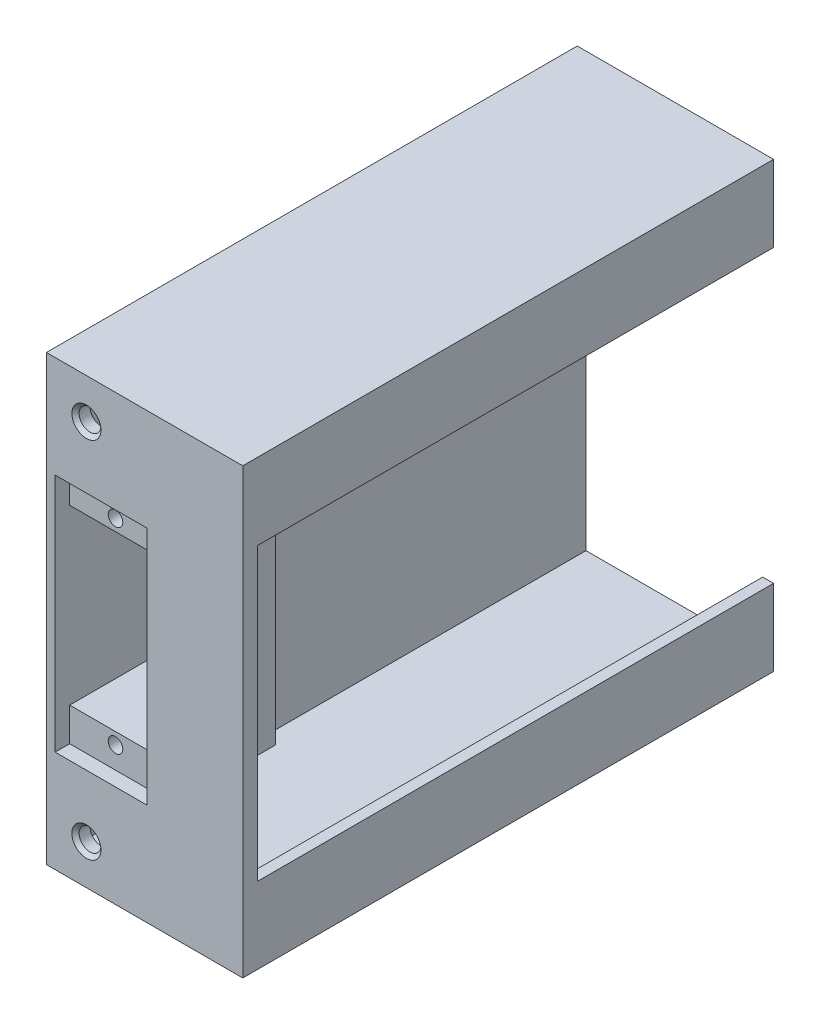
ISO-10303-21;
HEADER;
FILE_DESCRIPTION(('STEP AP214'),'2;1');
FILE_NAME('part.step','',(''),(''),'','','');
FILE_SCHEMA(('AUTOMOTIVE_DESIGN { 1 0 10303 214 1 1 1 1 }'));
ENDSEC;
DATA;
#1=APPLICATION_CONTEXT('core data for automotive mechanical design processes');
#2=APPLICATION_PROTOCOL_DEFINITION('international standard','automotive_design',2000,#1);
#3=PRODUCT_CONTEXT('',#1,'mechanical');
#4=PRODUCT('Part','Part','',(#3));
#5=PRODUCT_RELATED_PRODUCT_CATEGORY('part','',(#4));
#6=PRODUCT_DEFINITION_FORMATION('','',#4);
#7=PRODUCT_DEFINITION_CONTEXT('part definition',#1,'design');
#8=PRODUCT_DEFINITION('design','',#6,#7);
#9=PRODUCT_DEFINITION_SHAPE('','',#8);
#10=(LENGTH_UNIT() NAMED_UNIT(*) SI_UNIT(.MILLI.,.METRE.));
#11=(NAMED_UNIT(*) PLANE_ANGLE_UNIT() SI_UNIT($,.RADIAN.));
#12=(NAMED_UNIT(*) SI_UNIT($,.STERADIAN.) SOLID_ANGLE_UNIT());
#13=UNCERTAINTY_MEASURE_WITH_UNIT(LENGTH_MEASURE(1.E-05),#10,'distance_accuracy_value','');
#14=(GEOMETRIC_REPRESENTATION_CONTEXT(3) GLOBAL_UNCERTAINTY_ASSIGNED_CONTEXT((#13)) GLOBAL_UNIT_ASSIGNED_CONTEXT((#10,
#11,#12)) REPRESENTATION_CONTEXT('',''));
#15=CARTESIAN_POINT('',(0.,0.,0.));
#16=DIRECTION('',(0.,0.,1.));
#17=DIRECTION('',(1.,0.,0.));
#18=AXIS2_PLACEMENT_3D('',#15,#16,#17);
#19=CARTESIAN_POINT('',(25.5,20.,36.5));
#20=DIRECTION('',(0.,1.,0.));
#21=DIRECTION('',(0.,0.,1.));
#22=AXIS2_PLACEMENT_3D('',#19,#20,#21);
#23=PLANE('',#22);
#24=DIRECTION('',(-1.,0.,0.));
#25=VECTOR('',#24,1.);
#26=CARTESIAN_POINT('',(65.5499687890016,20.,34.5));
#27=LINE('',#26,#25);
#28=CARTESIAN_POINT('',(25.5,20.,34.5));
#29=VERTEX_POINT('',#28);
#30=CARTESIAN_POINT('',(24.,20.,34.5));
#31=VERTEX_POINT('',#30);
#32=EDGE_CURVE('E288',#29,#31,#27,.T.);
#33=ORIENTED_EDGE('',*,*,#32,.T.);
#34=DIRECTION('',(0.,0.,-1.));
#35=VECTOR('',#34,1.);
#36=CARTESIAN_POINT('',(24.,20.,36.5));
#37=LINE('',#36,#35);
#38=CARTESIAN_POINT('',(24.,20.,-36.5));
#39=VERTEX_POINT('',#38);
#40=EDGE_CURVE('E306',#31,#39,#37,.T.);
#41=ORIENTED_EDGE('',*,*,#40,.T.);
#42=DIRECTION('',(-1.,0.,0.));
#43=VECTOR('',#42,1.);
#44=CARTESIAN_POINT('',(25.5,20.,-36.5));
#45=LINE('',#44,#43);
#46=CARTESIAN_POINT('',(25.5,20.,-36.5));
#47=VERTEX_POINT('',#46);
#48=EDGE_CURVE('E318',#47,#39,#45,.T.);
#49=ORIENTED_EDGE('',*,*,#48,.F.);
#50=DIRECTION('',(0.,0.,-1.));
#51=VECTOR('',#50,1.);
#52=CARTESIAN_POINT('',(25.5,20.,36.5));
#53=LINE('',#52,#51);
#54=EDGE_CURVE('E309',#29,#47,#53,.T.);
#55=ORIENTED_EDGE('',*,*,#54,.F.);
#56=EDGE_LOOP('',(#33,#41,#49,#55));
#57=FACE_BOUND('',#56,.T.);
#58=ADVANCED_FACE('F37',(#57),#23,.F.);
#59=CARTESIAN_POINT('',(25.5,-20.,36.5));
#60=DIRECTION('',(0.,-1.,0.));
#61=DIRECTION('',(0.,0.,-1.));
#62=AXIS2_PLACEMENT_3D('',#59,#60,#61);
#63=PLANE('',#62);
#64=DIRECTION('',(-1.,0.,0.));
#65=VECTOR('',#64,1.);
#66=CARTESIAN_POINT('',(65.5499687890016,-20.,34.5));
#67=LINE('',#66,#65);
#68=CARTESIAN_POINT('',(25.5,-20.,34.5));
#69=VERTEX_POINT('',#68);
#70=CARTESIAN_POINT('',(24.,-20.,34.5));
#71=VERTEX_POINT('',#70);
#72=EDGE_CURVE('E281',#69,#71,#67,.T.);
#73=ORIENTED_EDGE('',*,*,#72,.F.);
#74=DIRECTION('',(0.,0.,1.));
#75=VECTOR('',#74,1.);
#76=CARTESIAN_POINT('',(25.5,-20.,36.5));
#77=LINE('',#76,#75);
#78=CARTESIAN_POINT('',(25.5,-20.,-36.5));
#79=VERTEX_POINT('',#78);
#80=EDGE_CURVE('E297',#79,#69,#77,.T.);
#81=ORIENTED_EDGE('',*,*,#80,.F.);
#82=DIRECTION('',(-1.,0.,0.));
#83=VECTOR('',#82,1.);
#84=CARTESIAN_POINT('',(25.5,-20.,-36.5));
#85=LINE('',#84,#83);
#86=CARTESIAN_POINT('',(24.,-20.,-36.5));
#87=VERTEX_POINT('',#86);
#88=EDGE_CURVE('E300',#79,#87,#85,.T.);
#89=ORIENTED_EDGE('',*,*,#88,.T.);
#90=DIRECTION('',(0.,0.,1.));
#91=VECTOR('',#90,1.);
#92=CARTESIAN_POINT('',(24.,-20.,36.5));
#93=LINE('',#92,#91);
#94=EDGE_CURVE('E295',#87,#71,#93,.T.);
#95=ORIENTED_EDGE('',*,*,#94,.T.);
#96=EDGE_LOOP('',(#73,#81,#89,#95));
#97=FACE_BOUND('',#96,.T.);
#98=ADVANCED_FACE('F435',(#97),#63,.F.);
#99=CARTESIAN_POINT('',(0.,0.,34.5));
#100=DIRECTION('',(0.,0.,1.));
#101=DIRECTION('',(1.,0.,0.));
#102=AXIS2_PLACEMENT_3D('',#99,#100,#101);
#103=PLANE('',#102);
#104=CARTESIAN_POINT('',(4.,25.,34.5));
#105=DIRECTION('',(0.,0.,-1.));
#106=DIRECTION('',(-1.,0.,0.));
#107=AXIS2_PLACEMENT_3D('',#104,#105,#106);
#108=CIRCLE('',#107,1.5);
#109=CARTESIAN_POINT('',(2.5,25.,34.5));
#110=VERTEX_POINT('',#109);
#111=EDGE_CURVE('E278',#110,#110,#108,.T.);
#112=ORIENTED_EDGE('',*,*,#111,.F.);
#113=EDGE_LOOP('',(#112));
#114=FACE_BOUND('',#113,.T.);
#115=CARTESIAN_POINT('',(4.,-25.,34.5));
#116=DIRECTION('',(0.,0.,-1.));
#117=DIRECTION('',(-1.,0.,0.));
#118=AXIS2_PLACEMENT_3D('',#115,#116,#117);
#119=CIRCLE('',#118,1.5);
#120=CARTESIAN_POINT('',(2.5,-25.,34.5));
#121=VERTEX_POINT('',#120);
#122=EDGE_CURVE('E277',#121,#121,#119,.T.);
#123=ORIENTED_EDGE('',*,*,#122,.F.);
#124=EDGE_LOOP('',(#123));
#125=FACE_BOUND('',#124,.T.);
#126=DIRECTION('',(0.,-1.,0.));
#127=VECTOR('',#126,1.);
#128=CARTESIAN_POINT('',(13.,17.5,34.5));
#129=LINE('',#128,#127);
#130=CARTESIAN_POINT('',(13.,17.5,34.5));
#131=VERTEX_POINT('',#130);
#132=CARTESIAN_POINT('',(13.,-17.5,34.5));
#133=VERTEX_POINT('',#132);
#134=EDGE_CURVE('E338',#131,#133,#129,.T.);
#135=ORIENTED_EDGE('',*,*,#134,.F.);
#136=DIRECTION('',(1.,0.,0.));
#137=VECTOR('',#136,1.);
#138=CARTESIAN_POINT('',(0.,17.5,34.5));
#139=LINE('',#138,#137);
#140=CARTESIAN_POINT('',(-0.299999999999987,17.5,34.5));
#141=VERTEX_POINT('',#140);
#142=EDGE_CURVE('E355',#141,#131,#139,.T.);
#143=ORIENTED_EDGE('',*,*,#142,.F.);
#144=DIRECTION('',(0.,1.,0.));
#145=VECTOR('',#144,1.);
#146=CARTESIAN_POINT('',(-0.299999999999986,29.,34.5));
#147=LINE('',#146,#145);
#148=CARTESIAN_POINT('',(-0.299999999999986,29.,34.5));
#149=VERTEX_POINT('',#148);
#150=EDGE_CURVE('E236',#141,#149,#147,.T.);
#151=ORIENTED_EDGE('',*,*,#150,.T.);
#152=DIRECTION('',(-1.,0.,0.));
#153=VECTOR('',#152,1.);
#154=CARTESIAN_POINT('',(0.,29.,34.5));
#155=LINE('',#154,#153);
#156=CARTESIAN_POINT('',(24.,29.,34.5));
#157=VERTEX_POINT('',#156);
#158=EDGE_CURVE('E367',#157,#149,#155,.T.);
#159=ORIENTED_EDGE('',*,*,#158,.F.);
#160=DIRECTION('',(0.,1.,0.));
#161=VECTOR('',#160,1.);
#162=CARTESIAN_POINT('',(24.,29.,34.5));
#163=LINE('',#162,#161);
#164=EDGE_CURVE('E363',#31,#157,#163,.T.);
#165=ORIENTED_EDGE('',*,*,#164,.F.);
#166=ORIENTED_EDGE('',*,*,#32,.F.);
#167=DIRECTION('',(0.,1.,0.));
#168=VECTOR('',#167,1.);
#169=CARTESIAN_POINT('',(25.5,-20.,34.5));
#170=LINE('',#169,#168);
#171=EDGE_CURVE('E284',#69,#29,#170,.T.);
#172=ORIENTED_EDGE('',*,*,#171,.F.);
#173=ORIENTED_EDGE('',*,*,#72,.T.);
#174=CARTESIAN_POINT('',(24.,-29.,34.5));
#175=VERTEX_POINT('',#174);
#176=EDGE_CURVE('E364',#175,#71,#163,.T.);
#177=ORIENTED_EDGE('',*,*,#176,.F.);
#178=DIRECTION('',(1.,0.,0.));
#179=VECTOR('',#178,1.);
#180=CARTESIAN_POINT('',(0.,-29.,34.5));
#181=LINE('',#180,#179);
#182=CARTESIAN_POINT('',(-0.299999999999993,-29.,34.5));
#183=VERTEX_POINT('',#182);
#184=EDGE_CURVE('E359',#183,#175,#181,.T.);
#185=ORIENTED_EDGE('',*,*,#184,.F.);
#186=DIRECTION('',(0.,1.,0.));
#187=VECTOR('',#186,1.);
#188=CARTESIAN_POINT('',(-0.299999999999993,-29.,34.5));
#189=LINE('',#188,#187);
#190=CARTESIAN_POINT('',(-0.299999999999991,-17.5,34.5));
#191=VERTEX_POINT('',#190);
#192=EDGE_CURVE('E228',#183,#191,#189,.T.);
#193=ORIENTED_EDGE('',*,*,#192,.T.);
#194=DIRECTION('',(-1.,0.,0.));
#195=VECTOR('',#194,1.);
#196=CARTESIAN_POINT('',(0.,-17.5,34.5));
#197=LINE('',#196,#195);
#198=EDGE_CURVE('E352',#133,#191,#197,.T.);
#199=ORIENTED_EDGE('',*,*,#198,.F.);
#200=EDGE_LOOP('',(#135,#143,#151,#159,#165,#166,#172,#173,#177,#185,#193,#199));
#201=FACE_BOUND('',#200,.T.);
#202=ADVANCED_FACE('F431',(#114,#125,#201),#103,.F.);
#203=CARTESIAN_POINT('',(24.,29.,-36.5));
#204=DIRECTION('',(0.,1.,0.));
#205=DIRECTION('',(0.,0.,1.));
#206=AXIS2_PLACEMENT_3D('',#203,#204,#205);
#207=PLANE('',#206);
#208=ORIENTED_EDGE('',*,*,#158,.T.);
#209=DIRECTION('',(0.,0.,-1.));
#210=VECTOR('',#209,1.);
#211=CARTESIAN_POINT('',(-0.299999999999986,29.,77.5007758568797));
#212=LINE('',#211,#210);
#213=CARTESIAN_POINT('',(-0.299999999999986,29.,-36.5));
#214=VERTEX_POINT('',#213);
#215=EDGE_CURVE('E251',#149,#214,#212,.T.);
#216=ORIENTED_EDGE('',*,*,#215,.T.);
#217=DIRECTION('',(-1.,0.,0.));
#218=VECTOR('',#217,1.);
#219=CARTESIAN_POINT('',(24.,29.,-36.5));
#220=LINE('',#219,#218);
#221=CARTESIAN_POINT('',(24.,29.,-36.5));
#222=VERTEX_POINT('',#221);
#223=EDGE_CURVE('E377',#222,#214,#220,.T.);
#224=ORIENTED_EDGE('',*,*,#223,.F.);
#225=DIRECTION('',(0.,0.,-1.));
#226=VECTOR('',#225,1.);
#227=CARTESIAN_POINT('',(24.,29.,-36.5));
#228=LINE('',#227,#226);
#229=EDGE_CURVE('E374',#157,#222,#228,.T.);
#230=ORIENTED_EDGE('',*,*,#229,.F.);
#231=EDGE_LOOP('',(#208,#216,#224,#230));
#232=FACE_BOUND('',#231,.T.);
#233=ADVANCED_FACE('F434',(#232),#207,.F.);
#234=CARTESIAN_POINT('',(24.,-29.,-36.5));
#235=DIRECTION('',(0.,-1.,0.));
#236=DIRECTION('',(0.,0.,-1.));
#237=AXIS2_PLACEMENT_3D('',#234,#235,#236);
#238=PLANE('',#237);
#239=DIRECTION('',(0.,0.,-1.));
#240=VECTOR('',#239,1.);
#241=CARTESIAN_POINT('',(-0.299999999999993,-29.,77.5007758568797));
#242=LINE('',#241,#240);
#243=CARTESIAN_POINT('',(-0.299999999999993,-29.,-36.5));
#244=VERTEX_POINT('',#243);
#245=EDGE_CURVE('E250',#183,#244,#242,.T.);
#246=ORIENTED_EDGE('',*,*,#245,.F.);
#247=ORIENTED_EDGE('',*,*,#184,.T.);
#248=DIRECTION('',(0.,0.,1.));
#249=VECTOR('',#248,1.);
#250=CARTESIAN_POINT('',(24.,-29.,-36.5));
#251=LINE('',#250,#249);
#252=CARTESIAN_POINT('',(24.,-29.,-36.5));
#253=VERTEX_POINT('',#252);
#254=EDGE_CURVE('E369',#253,#175,#251,.T.);
#255=ORIENTED_EDGE('',*,*,#254,.F.);
#256=DIRECTION('',(-1.,0.,0.));
#257=VECTOR('',#256,1.);
#258=CARTESIAN_POINT('',(24.,-29.,-36.5));
#259=LINE('',#258,#257);
#260=EDGE_CURVE('E372',#253,#244,#259,.T.);
#261=ORIENTED_EDGE('',*,*,#260,.T.);
#262=EDGE_LOOP('',(#246,#247,#255,#261));
#263=FACE_BOUND('',#262,.T.);
#264=ADVANCED_FACE('F502',(#263),#238,.F.);
#265=CARTESIAN_POINT('',(-1.5,-30.5,36.5));
#266=DIRECTION('',(0.,0.,1.));
#267=DIRECTION('',(1.,0.,0.));
#268=AXIS2_PLACEMENT_3D('',#265,#266,#267);
#269=PLANE('',#268);
#270=DIRECTION('',(0.,1.,0.));
#271=VECTOR('',#270,1.);
#272=CARTESIAN_POINT('',(12.3,-30.5,36.5));
#273=LINE('',#272,#271);
#274=CARTESIAN_POINT('',(12.3,-16.5,36.5));
#275=VERTEX_POINT('',#274);
#276=CARTESIAN_POINT('',(12.3,16.5,36.5));
#277=VERTEX_POINT('',#276);
#278=EDGE_CURVE('E271',#275,#277,#273,.T.);
#279=ORIENTED_EDGE('',*,*,#278,.F.);
#280=DIRECTION('',(1.,0.,0.));
#281=VECTOR('',#280,1.);
#282=CARTESIAN_POINT('',(12.,-16.5,36.5));
#283=LINE('',#282,#281);
#284=CARTESIAN_POINT('',(-0.300000000000003,-16.5,36.5));
#285=VERTEX_POINT('',#284);
#286=EDGE_CURVE('E208',#285,#275,#283,.T.);
#287=ORIENTED_EDGE('',*,*,#286,.F.);
#288=DIRECTION('',(0.,-1.,0.));
#289=VECTOR('',#288,1.);
#290=CARTESIAN_POINT('',(-0.300000000000005,-30.5,36.5));
#291=LINE('',#290,#289);
#292=CARTESIAN_POINT('',(-0.300000000000003,16.5,36.5));
#293=VERTEX_POINT('',#292);
#294=EDGE_CURVE('E11',#293,#285,#291,.T.);
#295=ORIENTED_EDGE('',*,*,#294,.F.);
#296=DIRECTION('',(-1.,0.,0.));
#297=VECTOR('',#296,1.);
#298=CARTESIAN_POINT('',(0.,16.5,36.5));
#299=LINE('',#298,#297);
#300=EDGE_CURVE('E207',#277,#293,#299,.T.);
#301=ORIENTED_EDGE('',*,*,#300,.F.);
#302=EDGE_LOOP('',(#279,#287,#295,#301));
#303=FACE_BOUND('',#302,.T.);
#304=CARTESIAN_POINT('',(4.,-25.,36.5));
#305=DIRECTION('',(0.,0.,1.));
#306=DIRECTION('',(1.,0.,0.));
#307=AXIS2_PLACEMENT_3D('',#304,#305,#306);
#308=CIRCLE('',#307,2.);
#309=CARTESIAN_POINT('',(6.,-25.,36.5));
#310=VERTEX_POINT('',#309);
#311=EDGE_CURVE('E409',#310,#310,#308,.F.);
#312=ORIENTED_EDGE('',*,*,#311,.T.);
#313=EDGE_LOOP('',(#312));
#314=FACE_BOUND('',#313,.T.);
#315=CARTESIAN_POINT('',(4.,25.,36.5));
#316=DIRECTION('',(0.,0.,1.));
#317=DIRECTION('',(1.,0.,0.));
#318=AXIS2_PLACEMENT_3D('',#315,#316,#317);
#319=CIRCLE('',#318,2.);
#320=CARTESIAN_POINT('',(6.,25.,36.5));
#321=VERTEX_POINT('',#320);
#322=EDGE_CURVE('E403',#321,#321,#319,.F.);
#323=ORIENTED_EDGE('',*,*,#322,.T.);
#324=EDGE_LOOP('',(#323));
#325=FACE_BOUND('',#324,.T.);
#326=DIRECTION('',(1.,0.,0.));
#327=VECTOR('',#326,1.);
#328=CARTESIAN_POINT('',(-1.5,-30.5,36.5));
#329=LINE('',#328,#327);
#330=CARTESIAN_POINT('',(-1.5,-30.5,36.5));
#331=VERTEX_POINT('',#330);
#332=CARTESIAN_POINT('',(25.5,-30.5,36.5));
#333=VERTEX_POINT('',#332);
#334=EDGE_CURVE('E391',#331,#333,#329,.T.);
#335=ORIENTED_EDGE('',*,*,#334,.T.);
#336=DIRECTION('',(0.,-1.,0.));
#337=VECTOR('',#336,1.);
#338=CARTESIAN_POINT('',(25.5,30.5,36.5));
#339=LINE('',#338,#337);
#340=CARTESIAN_POINT('',(25.5,30.5,36.5));
#341=VERTEX_POINT('',#340);
#342=EDGE_CURVE('E307',#341,#333,#339,.T.);
#343=ORIENTED_EDGE('',*,*,#342,.F.);
#344=DIRECTION('',(1.,0.,0.));
#345=VECTOR('',#344,1.);
#346=CARTESIAN_POINT('',(-1.5,30.5,36.5));
#347=LINE('',#346,#345);
#348=CARTESIAN_POINT('',(-1.5,30.5,36.5));
#349=VERTEX_POINT('',#348);
#350=EDGE_CURVE('E392',#349,#341,#347,.T.);
#351=ORIENTED_EDGE('',*,*,#350,.F.);
#352=DIRECTION('',(0.,-1.,0.));
#353=VECTOR('',#352,1.);
#354=CARTESIAN_POINT('',(-1.5,-30.5,36.5));
#355=LINE('',#354,#353);
#356=EDGE_CURVE('E379',#349,#331,#355,.T.);
#357=ORIENTED_EDGE('',*,*,#356,.T.);
#358=EDGE_LOOP('',(#335,#343,#351,#357));
#359=FACE_BOUND('',#358,.T.);
#360=ADVANCED_FACE('F414',(#303,#314,#325,#359),#269,.T.);
#361=CARTESIAN_POINT('',(-1.5,30.5,-36.5));
#362=DIRECTION('',(0.,1.,0.));
#363=DIRECTION('',(0.,0.,1.));
#364=AXIS2_PLACEMENT_3D('',#361,#362,#363);
#365=PLANE('',#364);
#366=ORIENTED_EDGE('',*,*,#350,.T.);
#367=DIRECTION('',(0.,0.,1.));
#368=VECTOR('',#367,1.);
#369=CARTESIAN_POINT('',(25.5,30.5,36.5));
#370=LINE('',#369,#368);
#371=CARTESIAN_POINT('',(25.5,30.5,-36.5));
#372=VERTEX_POINT('',#371);
#373=EDGE_CURVE('E315',#372,#341,#370,.T.);
#374=ORIENTED_EDGE('',*,*,#373,.F.);
#375=DIRECTION('',(1.,0.,0.));
#376=VECTOR('',#375,1.);
#377=CARTESIAN_POINT('',(-1.5,30.5,-36.5));
#378=LINE('',#377,#376);
#379=CARTESIAN_POINT('',(-1.5,30.5,-36.5));
#380=VERTEX_POINT('',#379);
#381=EDGE_CURVE('E395',#380,#372,#378,.T.);
#382=ORIENTED_EDGE('',*,*,#381,.F.);
#383=DIRECTION('',(0.,0.,1.));
#384=VECTOR('',#383,1.);
#385=CARTESIAN_POINT('',(-1.5,30.5,-36.5));
#386=LINE('',#385,#384);
#387=EDGE_CURVE('E388',#380,#349,#386,.T.);
#388=ORIENTED_EDGE('',*,*,#387,.T.);
#389=EDGE_LOOP('',(#366,#374,#382,#388));
#390=FACE_BOUND('',#389,.T.);
#391=ADVANCED_FACE('F480',(#390),#365,.T.);
#392=CARTESIAN_POINT('',(-1.5,-30.5,-36.5));
#393=DIRECTION('',(0.,0.,-1.));
#394=DIRECTION('',(-1.,0.,0.));
#395=AXIS2_PLACEMENT_3D('',#392,#393,#394);
#396=PLANE('',#395);
#397=DIRECTION('',(0.,1.,0.));
#398=VECTOR('',#397,1.);
#399=CARTESIAN_POINT('',(-0.299999999999986,29.,-36.5));
#400=LINE('',#399,#398);
#401=EDGE_CURVE('E239',#244,#214,#400,.T.);
#402=ORIENTED_EDGE('',*,*,#401,.F.);
#403=ORIENTED_EDGE('',*,*,#260,.F.);
#404=DIRECTION('',(0.,1.,0.));
#405=VECTOR('',#404,1.);
#406=CARTESIAN_POINT('',(24.,-30.5,-36.5));
#407=LINE('',#406,#405);
#408=EDGE_CURVE('E287',#253,#87,#407,.T.);
#409=ORIENTED_EDGE('',*,*,#408,.T.);
#410=ORIENTED_EDGE('',*,*,#88,.F.);
#411=DIRECTION('',(0.,1.,0.));
#412=VECTOR('',#411,1.);
#413=CARTESIAN_POINT('',(25.5,-30.5,-36.5));
#414=LINE('',#413,#412);
#415=CARTESIAN_POINT('',(25.5,-30.5,-36.5));
#416=VERTEX_POINT('',#415);
#417=EDGE_CURVE('E294',#416,#79,#414,.T.);
#418=ORIENTED_EDGE('',*,*,#417,.F.);
#419=DIRECTION('',(1.,0.,0.));
#420=VECTOR('',#419,1.);
#421=CARTESIAN_POINT('',(-1.5,-30.5,-36.5));
#422=LINE('',#421,#420);
#423=CARTESIAN_POINT('',(-1.5,-30.5,-36.5));
#424=VERTEX_POINT('',#423);
#425=EDGE_CURVE('E397',#424,#416,#422,.T.);
#426=ORIENTED_EDGE('',*,*,#425,.F.);
#427=DIRECTION('',(0.,1.,0.));
#428=VECTOR('',#427,1.);
#429=CARTESIAN_POINT('',(-1.5,-30.5,-36.5));
#430=LINE('',#429,#428);
#431=EDGE_CURVE('E385',#424,#380,#430,.T.);
#432=ORIENTED_EDGE('',*,*,#431,.T.);
#433=ORIENTED_EDGE('',*,*,#381,.T.);
#434=DIRECTION('',(0.,1.,0.));
#435=VECTOR('',#434,1.);
#436=CARTESIAN_POINT('',(25.5,30.5,-36.5));
#437=LINE('',#436,#435);
#438=EDGE_CURVE('E312',#47,#372,#437,.T.);
#439=ORIENTED_EDGE('',*,*,#438,.F.);
#440=ORIENTED_EDGE('',*,*,#48,.T.);
#441=DIRECTION('',(0.,1.,0.));
#442=VECTOR('',#441,1.);
#443=CARTESIAN_POINT('',(24.,30.5,-36.5));
#444=LINE('',#443,#442);
#445=EDGE_CURVE('E310',#39,#222,#444,.T.);
#446=ORIENTED_EDGE('',*,*,#445,.T.);
#447=ORIENTED_EDGE('',*,*,#223,.T.);
#448=EDGE_LOOP('',(#402,#403,#409,#410,#418,#426,#432,#433,#439,#440,#446,#447));
#449=FACE_BOUND('',#448,.T.);
#450=ADVANCED_FACE('F474',(#449),#396,.T.);
#451=CARTESIAN_POINT('',(-1.5,-30.5,-36.5));
#452=DIRECTION('',(0.,-1.,0.));
#453=DIRECTION('',(0.,0.,-1.));
#454=AXIS2_PLACEMENT_3D('',#451,#452,#453);
#455=PLANE('',#454);
#456=ORIENTED_EDGE('',*,*,#425,.T.);
#457=DIRECTION('',(0.,0.,-1.));
#458=VECTOR('',#457,1.);
#459=CARTESIAN_POINT('',(25.5,-30.5,36.5));
#460=LINE('',#459,#458);
#461=EDGE_CURVE('E291',#333,#416,#460,.T.);
#462=ORIENTED_EDGE('',*,*,#461,.F.);
#463=ORIENTED_EDGE('',*,*,#334,.F.);
#464=DIRECTION('',(0.,0.,-1.));
#465=VECTOR('',#464,1.);
#466=CARTESIAN_POINT('',(-1.5,-30.5,-36.5));
#467=LINE('',#466,#465);
#468=EDGE_CURVE('E382',#331,#424,#467,.T.);
#469=ORIENTED_EDGE('',*,*,#468,.T.);
#470=EDGE_LOOP('',(#456,#462,#463,#469));
#471=FACE_BOUND('',#470,.T.);
#472=ADVANCED_FACE('F489',(#471),#455,.T.);
#473=CARTESIAN_POINT('',(-1.5,0.,0.));
#474=DIRECTION('',(1.,0.,0.));
#475=DIRECTION('',(0.,0.,-1.));
#476=AXIS2_PLACEMENT_3D('',#473,#474,#475);
#477=PLANE('',#476);
#478=ORIENTED_EDGE('',*,*,#356,.F.);
#479=ORIENTED_EDGE('',*,*,#387,.F.);
#480=ORIENTED_EDGE('',*,*,#431,.F.);
#481=ORIENTED_EDGE('',*,*,#468,.F.);
#482=EDGE_LOOP('',(#478,#479,#480,#481));
#483=FACE_BOUND('',#482,.T.);
#484=ADVANCED_FACE('F486',(#483),#477,.F.);
#485=CARTESIAN_POINT('',(0.,17.5,19.5));
#486=DIRECTION('',(0.,-1.,0.));
#487=DIRECTION('',(0.,0.,-1.));
#488=AXIS2_PLACEMENT_3D('',#485,#486,#487);
#489=PLANE('',#488);
#490=ORIENTED_EDGE('',*,*,#142,.T.);
#491=DIRECTION('',(0.,0.,1.));
#492=VECTOR('',#491,1.);
#493=CARTESIAN_POINT('',(13.,17.5,19.5));
#494=LINE('',#493,#492);
#495=CARTESIAN_POINT('',(13.,17.5,19.5));
#496=VERTEX_POINT('',#495);
#497=EDGE_CURVE('E349',#496,#131,#494,.T.);
#498=ORIENTED_EDGE('',*,*,#497,.F.);
#499=DIRECTION('',(1.,0.,0.));
#500=VECTOR('',#499,1.);
#501=CARTESIAN_POINT('',(0.,17.5,19.5));
#502=LINE('',#501,#500);
#503=CARTESIAN_POINT('',(-0.299999999999987,17.5,19.5));
#504=VERTEX_POINT('',#503);
#505=EDGE_CURVE('E357',#504,#496,#502,.T.);
#506=ORIENTED_EDGE('',*,*,#505,.F.);
#507=DIRECTION('',(0.,0.,-1.));
#508=VECTOR('',#507,1.);
#509=CARTESIAN_POINT('',(-0.299999999999987,17.5,46.0039123779695));
#510=LINE('',#509,#508);
#511=EDGE_CURVE('E240',#141,#504,#510,.T.);
#512=ORIENTED_EDGE('',*,*,#511,.F.);
#513=EDGE_LOOP('',(#490,#498,#506,#512));
#514=FACE_BOUND('',#513,.T.);
#515=ADVANCED_FACE('F456',(#514),#489,.F.);
#516=CARTESIAN_POINT('',(0.,0.,19.5));
#517=DIRECTION('',(0.,0.,-1.));
#518=DIRECTION('',(-1.,0.,0.));
#519=AXIS2_PLACEMENT_3D('',#516,#517,#518);
#520=PLANE('',#519);
#521=DIRECTION('',(0.,-1.,0.));
#522=VECTOR('',#521,1.);
#523=CARTESIAN_POINT('',(-0.299999999999986,29.,19.5));
#524=LINE('',#523,#522);
#525=CARTESIAN_POINT('',(-0.3,11.9,19.5));
#526=VERTEX_POINT('',#525);
#527=EDGE_CURVE('E257',#504,#526,#524,.T.);
#528=ORIENTED_EDGE('',*,*,#527,.F.);
#529=ORIENTED_EDGE('',*,*,#505,.T.);
#530=DIRECTION('',(0.,-1.,0.));
#531=VECTOR('',#530,1.);
#532=CARTESIAN_POINT('',(13.,17.5,19.5));
#533=LINE('',#532,#531);
#534=CARTESIAN_POINT('',(13.,-17.5,19.5));
#535=VERTEX_POINT('',#534);
#536=EDGE_CURVE('E341',#496,#535,#533,.T.);
#537=ORIENTED_EDGE('',*,*,#536,.T.);
#538=DIRECTION('',(-1.,0.,0.));
#539=VECTOR('',#538,1.);
#540=CARTESIAN_POINT('',(0.,-17.5,19.5));
#541=LINE('',#540,#539);
#542=CARTESIAN_POINT('',(-0.299999999999991,-17.5,19.5));
#543=VERTEX_POINT('',#542);
#544=EDGE_CURVE('E353',#535,#543,#541,.T.);
#545=ORIENTED_EDGE('',*,*,#544,.T.);
#546=CARTESIAN_POINT('',(-0.299999999999991,-11.9,19.5));
#547=VERTEX_POINT('',#546);
#548=EDGE_CURVE('E254',#547,#543,#524,.T.);
#549=ORIENTED_EDGE('',*,*,#548,.F.);
#550=DIRECTION('',(-1.,0.,0.));
#551=VECTOR('',#550,1.);
#552=CARTESIAN_POINT('',(-0.300000000000003,-11.9,19.5));
#553=LINE('',#552,#551);
#554=CARTESIAN_POINT('',(12.3,-11.9,19.5));
#555=VERTEX_POINT('',#554);
#556=EDGE_CURVE('E265',#555,#547,#553,.T.);
#557=ORIENTED_EDGE('',*,*,#556,.F.);
#558=DIRECTION('',(0.,-1.,0.));
#559=VECTOR('',#558,1.);
#560=CARTESIAN_POINT('',(12.3,11.9,19.5));
#561=LINE('',#560,#559);
#562=CARTESIAN_POINT('',(12.3,11.9,19.5));
#563=VERTEX_POINT('',#562);
#564=EDGE_CURVE('E263',#563,#555,#561,.T.);
#565=ORIENTED_EDGE('',*,*,#564,.F.);
#566=DIRECTION('',(1.,0.,0.));
#567=VECTOR('',#566,1.);
#568=CARTESIAN_POINT('',(0.,11.9,19.5));
#569=LINE('',#568,#567);
#570=EDGE_CURVE('E260',#526,#563,#569,.T.);
#571=ORIENTED_EDGE('',*,*,#570,.F.);
#572=EDGE_LOOP('',(#528,#529,#537,#545,#549,#557,#565,#571));
#573=FACE_BOUND('',#572,.T.);
#574=ADVANCED_FACE('F452',(#573),#520,.T.);
#575=CARTESIAN_POINT('',(0.,-17.5,19.5));
#576=DIRECTION('',(0.,1.,0.));
#577=DIRECTION('',(0.,0.,1.));
#578=AXIS2_PLACEMENT_3D('',#575,#576,#577);
#579=PLANE('',#578);
#580=ORIENTED_EDGE('',*,*,#198,.T.);
#581=DIRECTION('',(0.,0.,-1.));
#582=VECTOR('',#581,1.);
#583=CARTESIAN_POINT('',(-0.299999999999991,-17.5,46.0039123779695));
#584=LINE('',#583,#582);
#585=EDGE_CURVE('E243',#191,#543,#584,.T.);
#586=ORIENTED_EDGE('',*,*,#585,.T.);
#587=ORIENTED_EDGE('',*,*,#544,.F.);
#588=DIRECTION('',(0.,0.,1.));
#589=VECTOR('',#588,1.);
#590=CARTESIAN_POINT('',(13.,-17.5,19.5));
#591=LINE('',#590,#589);
#592=EDGE_CURVE('E344',#535,#133,#591,.T.);
#593=ORIENTED_EDGE('',*,*,#592,.T.);
#594=EDGE_LOOP('',(#580,#586,#587,#593));
#595=FACE_BOUND('',#594,.T.);
#596=ADVANCED_FACE('F446',(#595),#579,.F.);
#597=CARTESIAN_POINT('',(13.,17.5,19.5));
#598=DIRECTION('',(-1.,0.,0.));
#599=DIRECTION('',(0.,-1.,0.));
#600=AXIS2_PLACEMENT_3D('',#597,#598,#599);
#601=PLANE('',#600);
#602=ORIENTED_EDGE('',*,*,#134,.T.);
#603=ORIENTED_EDGE('',*,*,#592,.F.);
#604=ORIENTED_EDGE('',*,*,#536,.F.);
#605=ORIENTED_EDGE('',*,*,#497,.T.);
#606=EDGE_LOOP('',(#602,#603,#604,#605));
#607=FACE_BOUND('',#606,.T.);
#608=ADVANCED_FACE('F442',(#607),#601,.F.);
#609=CARTESIAN_POINT('',(0.,16.5,34.5));
#610=DIRECTION('',(0.,1.,0.));
#611=DIRECTION('',(0.,0.,1.));
#612=AXIS2_PLACEMENT_3D('',#609,#610,#611);
#613=PLANE('',#612);
#614=ORIENTED_EDGE('',*,*,#300,.T.);
#615=DIRECTION('',(0.,0.,1.));
#616=VECTOR('',#615,1.);
#617=CARTESIAN_POINT('',(-0.300000000000003,16.5,21.0865738903142));
#618=LINE('',#617,#616);
#619=CARTESIAN_POINT('',(-0.300000000000003,16.5,34.5));
#620=VERTEX_POINT('',#619);
#621=EDGE_CURVE('E222',#620,#293,#618,.T.);
#622=ORIENTED_EDGE('',*,*,#621,.F.);
#623=DIRECTION('',(-1.,0.,0.));
#624=VECTOR('',#623,1.);
#625=CARTESIAN_POINT('',(0.,16.5,34.5));
#626=LINE('',#625,#624);
#627=CARTESIAN_POINT('',(12.3,16.5,34.5));
#628=VERTEX_POINT('',#627);
#629=EDGE_CURVE('E336',#628,#620,#626,.T.);
#630=ORIENTED_EDGE('',*,*,#629,.F.);
#631=DIRECTION('',(0.,0.,1.));
#632=VECTOR('',#631,1.);
#633=CARTESIAN_POINT('',(12.3,16.5,21.0865738903142));
#634=LINE('',#633,#632);
#635=EDGE_CURVE('E230',#628,#277,#634,.T.);
#636=ORIENTED_EDGE('',*,*,#635,.T.);
#637=EDGE_LOOP('',(#614,#622,#630,#636));
#638=FACE_BOUND('',#637,.T.);
#639=ADVANCED_FACE('F516',(#638),#613,.F.);
#640=CARTESIAN_POINT('',(0.,0.,34.5));
#641=DIRECTION('',(0.,0.,-1.));
#642=DIRECTION('',(-1.,0.,0.));
#643=AXIS2_PLACEMENT_3D('',#640,#641,#642);
#644=PLANE('',#643);
#645=CARTESIAN_POINT('',(6.,13.5,34.5));
#646=DIRECTION('',(0.,0.,1.));
#647=DIRECTION('',(1.,0.,0.));
#648=AXIS2_PLACEMENT_3D('',#645,#646,#647);
#649=CIRCLE('',#648,1.);
#650=CARTESIAN_POINT('',(7.,13.5,34.5));
#651=VERTEX_POINT('',#650);
#652=EDGE_CURVE('E328',#651,#651,#649,.T.);
#653=ORIENTED_EDGE('',*,*,#652,.F.);
#654=EDGE_LOOP('',(#653));
#655=FACE_BOUND('',#654,.T.);
#656=ORIENTED_EDGE('',*,*,#629,.T.);
#657=DIRECTION('',(0.,-1.,0.));
#658=VECTOR('',#657,1.);
#659=CARTESIAN_POINT('',(-0.300000000000003,16.5,34.5));
#660=LINE('',#659,#658);
#661=CARTESIAN_POINT('',(-0.3,11.9,34.5));
#662=VERTEX_POINT('',#661);
#663=EDGE_CURVE('E220',#620,#662,#660,.T.);
#664=ORIENTED_EDGE('',*,*,#663,.T.);
#665=DIRECTION('',(1.,0.,0.));
#666=VECTOR('',#665,1.);
#667=CARTESIAN_POINT('',(0.,11.9,34.5));
#668=LINE('',#667,#666);
#669=CARTESIAN_POINT('',(12.3,11.9,34.5));
#670=VERTEX_POINT('',#669);
#671=EDGE_CURVE('E46',#662,#670,#668,.T.);
#672=ORIENTED_EDGE('',*,*,#671,.T.);
#673=DIRECTION('',(0.,1.,0.));
#674=VECTOR('',#673,1.);
#675=CARTESIAN_POINT('',(12.3,11.9,34.5));
#676=LINE('',#675,#674);
#677=EDGE_CURVE('E229',#670,#628,#676,.T.);
#678=ORIENTED_EDGE('',*,*,#677,.T.);
#679=EDGE_LOOP('',(#656,#664,#672,#678));
#680=FACE_BOUND('',#679,.T.);
#681=ADVANCED_FACE('F519',(#655,#680),#644,.F.);
#682=CARTESIAN_POINT('',(12.,-16.5,34.5));
#683=DIRECTION('',(0.,-1.,0.));
#684=DIRECTION('',(0.,0.,-1.));
#685=AXIS2_PLACEMENT_3D('',#682,#683,#684);
#686=PLANE('',#685);
#687=ORIENTED_EDGE('',*,*,#286,.T.);
#688=DIRECTION('',(0.,0.,1.));
#689=VECTOR('',#688,1.);
#690=CARTESIAN_POINT('',(12.3,-16.5,21.0865738903142));
#691=LINE('',#690,#689);
#692=CARTESIAN_POINT('',(12.3,-16.5,34.5));
#693=VERTEX_POINT('',#692);
#694=EDGE_CURVE('E214',#693,#275,#691,.T.);
#695=ORIENTED_EDGE('',*,*,#694,.F.);
#696=DIRECTION('',(1.,0.,0.));
#697=VECTOR('',#696,1.);
#698=CARTESIAN_POINT('',(12.,-16.5,34.5));
#699=LINE('',#698,#697);
#700=CARTESIAN_POINT('',(-0.300000000000003,-16.5,34.5));
#701=VERTEX_POINT('',#700);
#702=EDGE_CURVE('E197',#701,#693,#699,.T.);
#703=ORIENTED_EDGE('',*,*,#702,.F.);
#704=DIRECTION('',(0.,0.,1.));
#705=VECTOR('',#704,1.);
#706=CARTESIAN_POINT('',(-0.300000000000003,-16.5,21.0865738903142));
#707=LINE('',#706,#705);
#708=EDGE_CURVE('E226',#701,#285,#707,.T.);
#709=ORIENTED_EDGE('',*,*,#708,.T.);
#710=EDGE_LOOP('',(#687,#695,#703,#709));
#711=FACE_BOUND('',#710,.T.);
#712=ADVANCED_FACE('F218',(#711),#686,.F.);
#713=CARTESIAN_POINT('',(0.,0.,34.5));
#714=DIRECTION('',(0.,0.,-1.));
#715=DIRECTION('',(-1.,0.,0.));
#716=AXIS2_PLACEMENT_3D('',#713,#714,#715);
#717=PLANE('',#716);
#718=CARTESIAN_POINT('',(6.,-13.5,34.5));
#719=DIRECTION('',(0.,0.,1.));
#720=DIRECTION('',(1.,0.,0.));
#721=AXIS2_PLACEMENT_3D('',#718,#719,#720);
#722=CIRCLE('',#721,1.);
#723=CARTESIAN_POINT('',(7.,-13.5,34.5));
#724=VERTEX_POINT('',#723);
#725=EDGE_CURVE('E324',#724,#724,#722,.T.);
#726=ORIENTED_EDGE('',*,*,#725,.F.);
#727=EDGE_LOOP('',(#726));
#728=FACE_BOUND('',#727,.T.);
#729=ORIENTED_EDGE('',*,*,#702,.T.);
#730=DIRECTION('',(0.,1.,0.));
#731=VECTOR('',#730,1.);
#732=CARTESIAN_POINT('',(12.3,-16.5,34.5));
#733=LINE('',#732,#731);
#734=CARTESIAN_POINT('',(12.3,-11.9,34.5));
#735=VERTEX_POINT('',#734);
#736=EDGE_CURVE('E200',#693,#735,#733,.T.);
#737=ORIENTED_EDGE('',*,*,#736,.T.);
#738=DIRECTION('',(-1.,0.,0.));
#739=VECTOR('',#738,1.);
#740=CARTESIAN_POINT('',(0.,-11.9,34.5));
#741=LINE('',#740,#739);
#742=CARTESIAN_POINT('',(-0.300000000000003,-11.9,34.5));
#743=VERTEX_POINT('',#742);
#744=EDGE_CURVE('E53',#735,#743,#741,.T.);
#745=ORIENTED_EDGE('',*,*,#744,.T.);
#746=DIRECTION('',(0.,-1.,0.));
#747=VECTOR('',#746,1.);
#748=CARTESIAN_POINT('',(-0.300000000000003,-11.9,34.5));
#749=LINE('',#748,#747);
#750=EDGE_CURVE('E202',#743,#701,#749,.T.);
#751=ORIENTED_EDGE('',*,*,#750,.T.);
#752=EDGE_LOOP('',(#729,#737,#745,#751));
#753=FACE_BOUND('',#752,.T.);
#754=ADVANCED_FACE('F199',(#728,#753),#717,.F.);
#755=CARTESIAN_POINT('',(6.,-13.5,24.5));
#756=DIRECTION('',(0.,0.,1.));
#757=DIRECTION('',(1.,0.,0.));
#758=AXIS2_PLACEMENT_3D('',#755,#756,#757);
#759=CYLINDRICAL_SURFACE('',#758,1.);
#760=CARTESIAN_POINT('',(6.,-13.5,24.5));
#761=DIRECTION('',(0.,0.,1.));
#762=DIRECTION('',(1.,0.,0.));
#763=AXIS2_PLACEMENT_3D('',#760,#761,#762);
#764=CIRCLE('',#763,1.);
#765=CARTESIAN_POINT('',(7.,-13.5,24.5));
#766=VERTEX_POINT('',#765);
#767=EDGE_CURVE('E331',#766,#766,#764,.T.);
#768=ORIENTED_EDGE('',*,*,#767,.F.);
#769=EDGE_LOOP('',(#768));
#770=FACE_BOUND('',#769,.T.);
#771=ORIENTED_EDGE('',*,*,#725,.T.);
#772=EDGE_LOOP('',(#771));
#773=FACE_BOUND('',#772,.T.);
#774=ADVANCED_FACE('F550',(#770,#773),#759,.F.);
#775=CARTESIAN_POINT('',(6.,-13.5,24.5));
#776=DIRECTION('',(0.,0.,1.));
#777=DIRECTION('',(1.,0.,0.));
#778=AXIS2_PLACEMENT_3D('',#775,#776,#777);
#779=PLANE('',#778);
#780=ORIENTED_EDGE('',*,*,#767,.T.);
#781=EDGE_LOOP('',(#780));
#782=FACE_BOUND('',#781,.T.);
#783=ADVANCED_FACE('F547',(#782),#779,.T.);
#784=CARTESIAN_POINT('',(6.,13.5,24.5));
#785=DIRECTION('',(0.,0.,1.));
#786=DIRECTION('',(1.,0.,0.));
#787=AXIS2_PLACEMENT_3D('',#784,#785,#786);
#788=CYLINDRICAL_SURFACE('',#787,1.);
#789=CARTESIAN_POINT('',(6.,13.5,24.5));
#790=DIRECTION('',(0.,0.,1.));
#791=DIRECTION('',(1.,0.,0.));
#792=AXIS2_PLACEMENT_3D('',#789,#790,#791);
#793=CIRCLE('',#792,1.);
#794=CARTESIAN_POINT('',(7.,13.5,24.5));
#795=VERTEX_POINT('',#794);
#796=EDGE_CURVE('E325',#795,#795,#793,.T.);
#797=ORIENTED_EDGE('',*,*,#796,.F.);
#798=EDGE_LOOP('',(#797));
#799=FACE_BOUND('',#798,.T.);
#800=ORIENTED_EDGE('',*,*,#652,.T.);
#801=EDGE_LOOP('',(#800));
#802=FACE_BOUND('',#801,.T.);
#803=ADVANCED_FACE('F543',(#799,#802),#788,.F.);
#804=CARTESIAN_POINT('',(6.,13.5,24.5));
#805=DIRECTION('',(0.,0.,1.));
#806=DIRECTION('',(1.,0.,0.));
#807=AXIS2_PLACEMENT_3D('',#804,#805,#806);
#808=PLANE('',#807);
#809=ORIENTED_EDGE('',*,*,#796,.T.);
#810=EDGE_LOOP('',(#809));
#811=FACE_BOUND('',#810,.T.);
#812=ADVANCED_FACE('F540',(#811),#808,.T.);
#813=CARTESIAN_POINT('',(24.,0.,0.));
#814=DIRECTION('',(1.,0.,0.));
#815=DIRECTION('',(0.,0.,-1.));
#816=AXIS2_PLACEMENT_3D('',#813,#814,#815);
#817=PLANE('',#816);
#818=ORIENTED_EDGE('',*,*,#40,.F.);
#819=ORIENTED_EDGE('',*,*,#164,.T.);
#820=ORIENTED_EDGE('',*,*,#229,.T.);
#821=ORIENTED_EDGE('',*,*,#445,.F.);
#822=EDGE_LOOP('',(#818,#819,#820,#821));
#823=FACE_BOUND('',#822,.T.);
#824=ADVANCED_FACE('F467',(#823),#817,.F.);
#825=CARTESIAN_POINT('',(25.5,0.,0.));
#826=DIRECTION('',(1.,0.,0.));
#827=DIRECTION('',(0.,0.,-1.));
#828=AXIS2_PLACEMENT_3D('',#825,#826,#827);
#829=PLANE('',#828);
#830=ORIENTED_EDGE('',*,*,#342,.T.);
#831=ORIENTED_EDGE('',*,*,#461,.T.);
#832=ORIENTED_EDGE('',*,*,#417,.T.);
#833=ORIENTED_EDGE('',*,*,#80,.T.);
#834=ORIENTED_EDGE('',*,*,#171,.T.);
#835=ORIENTED_EDGE('',*,*,#54,.T.);
#836=ORIENTED_EDGE('',*,*,#438,.T.);
#837=ORIENTED_EDGE('',*,*,#373,.T.);
#838=EDGE_LOOP('',(#830,#831,#832,#833,#834,#835,#836,#837));
#839=FACE_BOUND('',#838,.T.);
#840=ADVANCED_FACE('F477',(#839),#829,.T.);
#841=CARTESIAN_POINT('',(24.,0.,0.));
#842=DIRECTION('',(-1.,0.,0.));
#843=DIRECTION('',(0.,0.,1.));
#844=AXIS2_PLACEMENT_3D('',#841,#842,#843);
#845=PLANE('',#844);
#846=ORIENTED_EDGE('',*,*,#176,.T.);
#847=ORIENTED_EDGE('',*,*,#94,.F.);
#848=ORIENTED_EDGE('',*,*,#408,.F.);
#849=ORIENTED_EDGE('',*,*,#254,.T.);
#850=EDGE_LOOP('',(#846,#847,#848,#849));
#851=FACE_BOUND('',#850,.T.);
#852=ADVANCED_FACE('F427',(#851),#845,.T.);
#853=CARTESIAN_POINT('',(4.,-25.,39.5));
#854=DIRECTION('',(0.,0.,-1.));
#855=DIRECTION('',(-1.,0.,0.));
#856=AXIS2_PLACEMENT_3D('',#853,#854,#855);
#857=CYLINDRICAL_SURFACE('',#856,1.5);
#858=CARTESIAN_POINT('',(4.,-25.,36.));
#859=DIRECTION('',(0.,0.,1.));
#860=DIRECTION('',(1.,0.,0.));
#861=AXIS2_PLACEMENT_3D('',#858,#859,#860);
#862=CIRCLE('',#861,1.5);
#863=CARTESIAN_POINT('',(5.5,-25.,36.));
#864=VERTEX_POINT('',#863);
#865=EDGE_CURVE('E406',#864,#864,#862,.T.);
#866=ORIENTED_EDGE('',*,*,#865,.T.);
#867=EDGE_LOOP('',(#866));
#868=FACE_BOUND('',#867,.T.);
#869=ORIENTED_EDGE('',*,*,#122,.T.);
#870=EDGE_LOOP('',(#869));
#871=FACE_BOUND('',#870,.T.);
#872=ADVANCED_FACE('F423',(#868,#871),#857,.F.);
#873=CARTESIAN_POINT('',(4.,25.,39.5));
#874=DIRECTION('',(0.,0.,-1.));
#875=DIRECTION('',(-1.,0.,0.));
#876=AXIS2_PLACEMENT_3D('',#873,#874,#875);
#877=CYLINDRICAL_SURFACE('',#876,1.5);
#878=CARTESIAN_POINT('',(4.,25.,36.));
#879=DIRECTION('',(0.,0.,1.));
#880=DIRECTION('',(1.,0.,0.));
#881=AXIS2_PLACEMENT_3D('',#878,#879,#880);
#882=CIRCLE('',#881,1.5);
#883=CARTESIAN_POINT('',(5.5,25.,36.));
#884=VERTEX_POINT('',#883);
#885=EDGE_CURVE('E394',#884,#884,#882,.T.);
#886=ORIENTED_EDGE('',*,*,#885,.T.);
#887=EDGE_LOOP('',(#886));
#888=FACE_BOUND('',#887,.T.);
#889=ORIENTED_EDGE('',*,*,#111,.T.);
#890=EDGE_LOOP('',(#889));
#891=FACE_BOUND('',#890,.T.);
#892=ADVANCED_FACE('F426',(#888,#891),#877,.F.);
#893=CARTESIAN_POINT('',(4.,25.,36.));
#894=DIRECTION('',(0.,0.,1.));
#895=DIRECTION('',(1.,0.,0.));
#896=AXIS2_PLACEMENT_3D('',#893,#894,#895);
#897=CONICAL_SURFACE('',#896,1.5,0.785398163397441);
#898=ORIENTED_EDGE('',*,*,#322,.F.);
#899=EDGE_LOOP('',(#898));
#900=FACE_BOUND('',#899,.T.);
#901=ORIENTED_EDGE('',*,*,#885,.F.);
#902=EDGE_LOOP('',(#901));
#903=FACE_BOUND('',#902,.T.);
#904=ADVANCED_FACE('F420',(#900,#903),#897,.F.);
#905=CARTESIAN_POINT('',(4.,-25.,36.));
#906=DIRECTION('',(0.,0.,1.));
#907=DIRECTION('',(1.,0.,0.));
#908=AXIS2_PLACEMENT_3D('',#905,#906,#907);
#909=CONICAL_SURFACE('',#908,1.5,0.785398163397441);
#910=ORIENTED_EDGE('',*,*,#311,.F.);
#911=EDGE_LOOP('',(#910));
#912=FACE_BOUND('',#911,.T.);
#913=ORIENTED_EDGE('',*,*,#865,.F.);
#914=EDGE_LOOP('',(#913));
#915=FACE_BOUND('',#914,.T.);
#916=ADVANCED_FACE('F40',(#912,#915),#909,.F.);
#917=CARTESIAN_POINT('',(-0.3,11.9,67.5));
#918=DIRECTION('',(-1.,0.,0.));
#919=DIRECTION('',(0.,-1.,0.));
#920=AXIS2_PLACEMENT_3D('',#917,#918,#919);
#921=PLANE('',#920);
#922=ORIENTED_EDGE('',*,*,#294,.T.);
#923=ORIENTED_EDGE('',*,*,#708,.F.);
#924=ORIENTED_EDGE('',*,*,#750,.F.);
#925=DIRECTION('',(0.,0.,-1.));
#926=VECTOR('',#925,1.);
#927=CARTESIAN_POINT('',(-0.300000000000003,-11.9,67.5));
#928=LINE('',#927,#926);
#929=EDGE_CURVE('E272',#743,#547,#928,.T.);
#930=ORIENTED_EDGE('',*,*,#929,.T.);
#931=ORIENTED_EDGE('',*,*,#548,.T.);
#932=ORIENTED_EDGE('',*,*,#585,.F.);
#933=ORIENTED_EDGE('',*,*,#192,.F.);
#934=ORIENTED_EDGE('',*,*,#245,.T.);
#935=ORIENTED_EDGE('',*,*,#401,.T.);
#936=ORIENTED_EDGE('',*,*,#215,.F.);
#937=ORIENTED_EDGE('',*,*,#150,.F.);
#938=ORIENTED_EDGE('',*,*,#511,.T.);
#939=ORIENTED_EDGE('',*,*,#527,.T.);
#940=DIRECTION('',(0.,0.,-1.));
#941=VECTOR('',#940,1.);
#942=CARTESIAN_POINT('',(-0.3,11.9,67.5));
#943=LINE('',#942,#941);
#944=EDGE_CURVE('E269',#662,#526,#943,.T.);
#945=ORIENTED_EDGE('',*,*,#944,.F.);
#946=ORIENTED_EDGE('',*,*,#663,.F.);
#947=ORIENTED_EDGE('',*,*,#621,.T.);
#948=EDGE_LOOP('',(#922,#923,#924,#930,#931,#932,#933,#934,#935,#936,#937,#938,#939,#945,#946,#947));
#949=FACE_BOUND('',#948,.T.);
#950=ADVANCED_FACE('F419',(#949),#921,.F.);
#951=CARTESIAN_POINT('',(-0.300000000000003,-11.9,67.5));
#952=DIRECTION('',(0.,-1.,0.));
#953=DIRECTION('',(0.,0.,-1.));
#954=AXIS2_PLACEMENT_3D('',#951,#952,#953);
#955=PLANE('',#954);
#956=ORIENTED_EDGE('',*,*,#929,.F.);
#957=ORIENTED_EDGE('',*,*,#744,.F.);
#958=DIRECTION('',(0.,0.,-1.));
#959=VECTOR('',#958,1.);
#960=CARTESIAN_POINT('',(12.3,-11.9,67.5));
#961=LINE('',#960,#959);
#962=EDGE_CURVE('E216',#735,#555,#961,.T.);
#963=ORIENTED_EDGE('',*,*,#962,.T.);
#964=ORIENTED_EDGE('',*,*,#556,.T.);
#965=EDGE_LOOP('',(#956,#957,#963,#964));
#966=FACE_BOUND('',#965,.T.);
#967=ADVANCED_FACE('F508',(#966),#955,.F.);
#968=CARTESIAN_POINT('',(12.3,11.9,67.5));
#969=DIRECTION('',(1.,0.,0.));
#970=DIRECTION('',(0.,1.,0.));
#971=AXIS2_PLACEMENT_3D('',#968,#969,#970);
#972=PLANE('',#971);
#973=ORIENTED_EDGE('',*,*,#278,.T.);
#974=ORIENTED_EDGE('',*,*,#635,.F.);
#975=ORIENTED_EDGE('',*,*,#677,.F.);
#976=DIRECTION('',(0.,0.,-1.));
#977=VECTOR('',#976,1.);
#978=CARTESIAN_POINT('',(12.3,11.9,67.5));
#979=LINE('',#978,#977);
#980=EDGE_CURVE('E268',#670,#563,#979,.T.);
#981=ORIENTED_EDGE('',*,*,#980,.T.);
#982=ORIENTED_EDGE('',*,*,#564,.T.);
#983=ORIENTED_EDGE('',*,*,#962,.F.);
#984=ORIENTED_EDGE('',*,*,#736,.F.);
#985=ORIENTED_EDGE('',*,*,#694,.T.);
#986=EDGE_LOOP('',(#973,#974,#975,#981,#982,#983,#984,#985));
#987=FACE_BOUND('',#986,.T.);
#988=ADVANCED_FACE('F213',(#987),#972,.F.);
#989=CARTESIAN_POINT('',(0.,11.9,67.5));
#990=DIRECTION('',(0.,1.,0.));
#991=DIRECTION('',(-1.,0.,0.));
#992=AXIS2_PLACEMENT_3D('',#989,#990,#991);
#993=PLANE('',#992);
#994=ORIENTED_EDGE('',*,*,#980,.F.);
#995=ORIENTED_EDGE('',*,*,#671,.F.);
#996=ORIENTED_EDGE('',*,*,#944,.T.);
#997=ORIENTED_EDGE('',*,*,#570,.T.);
#998=EDGE_LOOP('',(#994,#995,#996,#997));
#999=FACE_BOUND('',#998,.T.);
#1000=ADVANCED_FACE('F512',(#999),#993,.F.);
#1001=CLOSED_SHELL('',(#58,#98,#202,#233,#264,#360,#391,#450,#472,#484,#515,#574,#596,#608,#639,
#681,#712,#754,#774,#783,#803,#812,#824,#840,#852,#872,#892,#904,#916,#950,#967,#988,#1000));
#1002=MANIFOLD_SOLID_BREP('B2',#1001);
#1003=ADVANCED_BREP_SHAPE_REPRESENTATION('',(#18,#1002),#14);
#1004=SHAPE_DEFINITION_REPRESENTATION(#9,#1003);
ENDSEC;
END-ISO-10303-21;
